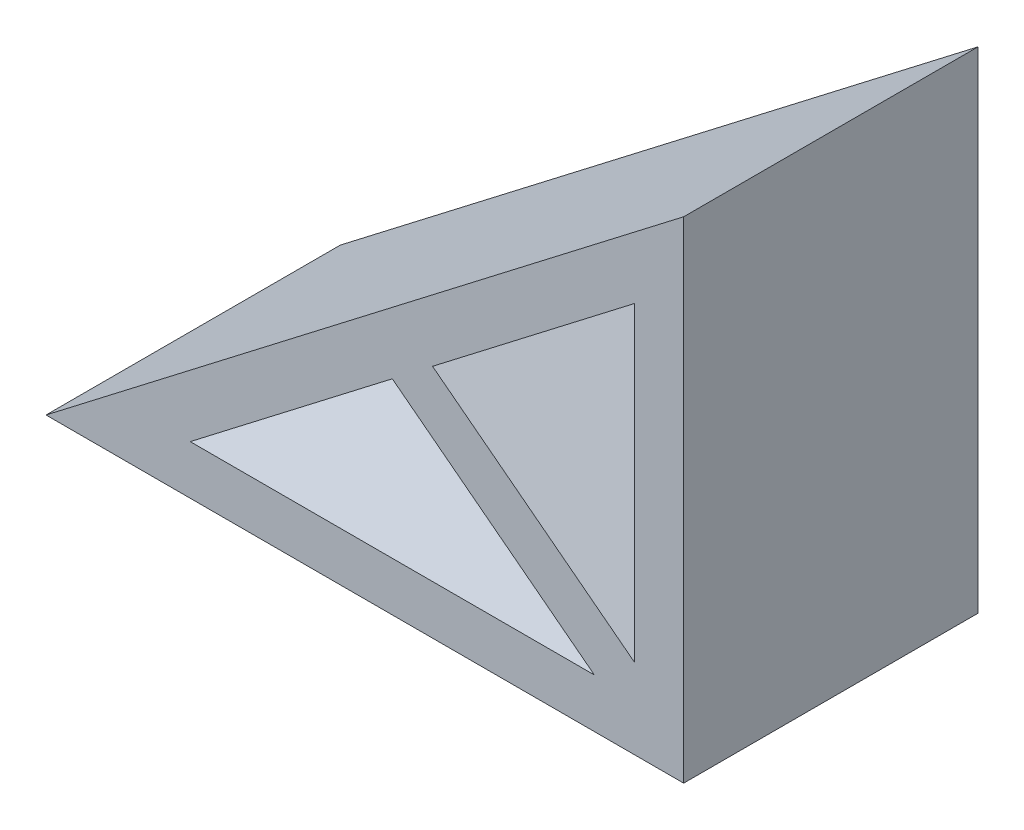
ISO-10303-21;
HEADER;
FILE_DESCRIPTION(('STEP AP214'),'2;1');
FILE_NAME('part.step','',(''),(''),'','','');
FILE_SCHEMA(('AUTOMOTIVE_DESIGN { 1 0 10303 214 1 1 1 1 }'));
ENDSEC;
DATA;
#1=APPLICATION_CONTEXT('core data for automotive mechanical design processes');
#2=APPLICATION_PROTOCOL_DEFINITION('international standard','automotive_design',2000,#1);
#3=PRODUCT_CONTEXT('',#1,'mechanical');
#4=PRODUCT('Part','Part','',(#3));
#5=PRODUCT_RELATED_PRODUCT_CATEGORY('part','',(#4));
#6=PRODUCT_DEFINITION_FORMATION('','',#4);
#7=PRODUCT_DEFINITION_CONTEXT('part definition',#1,'design');
#8=PRODUCT_DEFINITION('design','',#6,#7);
#9=PRODUCT_DEFINITION_SHAPE('','',#8);
#10=(LENGTH_UNIT() NAMED_UNIT(*) SI_UNIT(.MILLI.,.METRE.));
#11=(NAMED_UNIT(*) PLANE_ANGLE_UNIT() SI_UNIT($,.RADIAN.));
#12=(NAMED_UNIT(*) SI_UNIT($,.STERADIAN.) SOLID_ANGLE_UNIT());
#13=UNCERTAINTY_MEASURE_WITH_UNIT(LENGTH_MEASURE(1.E-05),#10,'distance_accuracy_value','');
#14=(GEOMETRIC_REPRESENTATION_CONTEXT(3) GLOBAL_UNCERTAINTY_ASSIGNED_CONTEXT((#13)) GLOBAL_UNIT_ASSIGNED_CONTEXT((#10,
#11,#12)) REPRESENTATION_CONTEXT('',''));
#15=CARTESIAN_POINT('',(0.,0.,0.));
#16=DIRECTION('',(0.,0.,1.));
#17=DIRECTION('',(1.,0.,0.));
#18=AXIS2_PLACEMENT_3D('',#15,#16,#17);
#19=CARTESIAN_POINT('',(0.,31.75,9.525));
#20=DIRECTION('',(-1.,0.,0.));
#21=DIRECTION('',(0.,0.,1.));
#22=AXIS2_PLACEMENT_3D('',#19,#20,#21);
#23=PLANE('',#22);
#24=DIRECTION('',(0.,1.,0.));
#25=VECTOR('',#24,1.);
#26=CARTESIAN_POINT('',(0.,31.75,-9.525));
#27=LINE('',#26,#25);
#28=CARTESIAN_POINT('',(0.,0.,-9.525));
#29=VERTEX_POINT('',#28);
#30=CARTESIAN_POINT('',(0.,31.75,-9.525));
#31=VERTEX_POINT('',#30);
#32=EDGE_CURVE('E152',#29,#31,#27,.T.);
#33=ORIENTED_EDGE('',*,*,#32,.T.);
#34=DIRECTION('',(0.,0.,-1.));
#35=VECTOR('',#34,1.);
#36=CARTESIAN_POINT('',(0.,31.75,9.525));
#37=LINE('',#36,#35);
#38=CARTESIAN_POINT('',(0.,31.75,9.525));
#39=VERTEX_POINT('',#38);
#40=EDGE_CURVE('E11',#39,#31,#37,.T.);
#41=ORIENTED_EDGE('',*,*,#40,.F.);
#42=DIRECTION('',(0.,1.,0.));
#43=VECTOR('',#42,1.);
#44=CARTESIAN_POINT('',(0.,31.75,9.525));
#45=LINE('',#44,#43);
#46=CARTESIAN_POINT('',(0.,0.,9.525));
#47=VERTEX_POINT('',#46);
#48=EDGE_CURVE('E156',#47,#39,#45,.T.);
#49=ORIENTED_EDGE('',*,*,#48,.F.);
#50=DIRECTION('',(0.,0.,-1.));
#51=VECTOR('',#50,1.);
#52=CARTESIAN_POINT('',(0.,0.,9.525));
#53=LINE('',#52,#51);
#54=EDGE_CURVE('E164',#47,#29,#53,.T.);
#55=ORIENTED_EDGE('',*,*,#54,.T.);
#56=EDGE_LOOP('',(#33,#41,#49,#55));
#57=FACE_BOUND('',#56,.T.);
#58=ADVANCED_FACE('F32',(#57),#23,.F.);
#59=CARTESIAN_POINT('',(-41.275,0.,9.525));
#60=DIRECTION('',(0.609710760849693,-0.7926239891046,0.));
#61=DIRECTION('',(0.7926239891046,0.609710760849693,0.));
#62=AXIS2_PLACEMENT_3D('',#59,#60,#61);
#63=PLANE('',#62);
#64=DIRECTION('',(-0.7926239891046,-0.609710760849693,0.));
#65=VECTOR('',#64,1.);
#66=CARTESIAN_POINT('',(-41.275,0.,-9.525));
#67=LINE('',#66,#65);
#68=CARTESIAN_POINT('',(-41.275,0.,-9.525));
#69=VERTEX_POINT('',#68);
#70=EDGE_CURVE('E167',#31,#69,#67,.T.);
#71=ORIENTED_EDGE('',*,*,#70,.T.);
#72=DIRECTION('',(0.,0.,-1.));
#73=VECTOR('',#72,1.);
#74=CARTESIAN_POINT('',(-41.275,0.,9.525));
#75=LINE('',#74,#73);
#76=CARTESIAN_POINT('',(-41.275,0.,9.525));
#77=VERTEX_POINT('',#76);
#78=EDGE_CURVE('E39',#77,#69,#75,.T.);
#79=ORIENTED_EDGE('',*,*,#78,.F.);
#80=DIRECTION('',(-0.7926239891046,-0.609710760849693,0.));
#81=VECTOR('',#80,1.);
#82=CARTESIAN_POINT('',(-41.275,0.,9.525));
#83=LINE('',#82,#81);
#84=EDGE_CURVE('E159',#39,#77,#83,.T.);
#85=ORIENTED_EDGE('',*,*,#84,.F.);
#86=ORIENTED_EDGE('',*,*,#40,.T.);
#87=EDGE_LOOP('',(#71,#79,#85,#86));
#88=FACE_BOUND('',#87,.T.);
#89=ADVANCED_FACE('F186',(#88),#63,.F.);
#90=CARTESIAN_POINT('',(0.,0.,9.525));
#91=DIRECTION('',(0.,1.,0.));
#92=DIRECTION('',(-1.,0.,0.));
#93=AXIS2_PLACEMENT_3D('',#90,#91,#92);
#94=PLANE('',#93);
#95=DIRECTION('',(1.,0.,0.));
#96=VECTOR('',#95,1.);
#97=CARTESIAN_POINT('',(0.,0.,-9.525));
#98=LINE('',#97,#96);
#99=EDGE_CURVE('E160',#69,#29,#98,.T.);
#100=ORIENTED_EDGE('',*,*,#99,.T.);
#101=ORIENTED_EDGE('',*,*,#54,.F.);
#102=DIRECTION('',(1.,0.,0.));
#103=VECTOR('',#102,1.);
#104=CARTESIAN_POINT('',(0.,0.,9.525));
#105=LINE('',#104,#103);
#106=EDGE_CURVE('E162',#77,#47,#105,.T.);
#107=ORIENTED_EDGE('',*,*,#106,.F.);
#108=ORIENTED_EDGE('',*,*,#78,.T.);
#109=EDGE_LOOP('',(#100,#101,#107,#108));
#110=FACE_BOUND('',#109,.T.);
#111=ADVANCED_FACE('F176',(#110),#94,.F.);
#112=CARTESIAN_POINT('',(0.,0.,9.525));
#113=DIRECTION('',(0.,0.,-1.));
#114=DIRECTION('',(-1.,0.,0.));
#115=AXIS2_PLACEMENT_3D('',#112,#113,#114);
#116=PLANE('',#115);
#117=DIRECTION('',(-0.7926239891046,0.609710760849693,0.));
#118=VECTOR('',#117,1.);
#119=CARTESIAN_POINT('',(-5.7786935903635,3.175,9.525));
#120=LINE('',#119,#118);
#121=CARTESIAN_POINT('',(-5.7786935903635,3.175,9.525));
#122=VERTEX_POINT('',#121);
#123=CARTESIAN_POINT('',(-18.8594032048182,13.2370843188113,9.525));
#124=VERTEX_POINT('',#123);
#125=EDGE_CURVE('E116',#122,#124,#120,.T.);
#126=ORIENTED_EDGE('',*,*,#125,.F.);
#127=DIRECTION('',(1.,0.,0.));
#128=VECTOR('',#127,1.);
#129=CARTESIAN_POINT('',(-31.940112819273,3.175,9.525));
#130=LINE('',#129,#128);
#131=CARTESIAN_POINT('',(-31.940112819273,3.175,9.525));
#132=VERTEX_POINT('',#131);
#133=EDGE_CURVE('E46',#132,#122,#130,.T.);
#134=ORIENTED_EDGE('',*,*,#133,.F.);
#135=DIRECTION('',(-0.7926239891046,-0.609710760849693,0.));
#136=VECTOR('',#135,1.);
#137=CARTESIAN_POINT('',(-18.8594032048182,13.2370843188113,9.525));
#138=LINE('',#137,#136);
#139=EDGE_CURVE('E106',#124,#132,#138,.T.);
#140=ORIENTED_EDGE('',*,*,#139,.F.);
#141=EDGE_LOOP('',(#126,#134,#140));
#142=FACE_BOUND('',#141,.T.);
#143=DIRECTION('',(-0.7926239891046,-0.609710760849693,0.));
#144=VECTOR('',#143,1.);
#145=CARTESIAN_POINT('',(-3.175,25.3020098609792,9.525));
#146=LINE('',#145,#144);
#147=CARTESIAN_POINT('',(-3.175,25.3020098609792,9.525));
#148=VERTEX_POINT('',#147);
#149=CARTESIAN_POINT('',(-16.2557096144547,15.2399255421679,9.525));
#150=VERTEX_POINT('',#149);
#151=EDGE_CURVE('E134',#148,#150,#146,.T.);
#152=ORIENTED_EDGE('',*,*,#151,.F.);
#153=DIRECTION('',(0.,1.,0.));
#154=VECTOR('',#153,1.);
#155=CARTESIAN_POINT('',(-3.175,5.17784122335654,9.525));
#156=LINE('',#155,#154);
#157=CARTESIAN_POINT('',(-3.175,5.17784122335654,9.525));
#158=VERTEX_POINT('',#157);
#159=EDGE_CURVE('E54',#158,#148,#156,.T.);
#160=ORIENTED_EDGE('',*,*,#159,.F.);
#161=DIRECTION('',(0.7926239891046,-0.609710760849693,0.));
#162=VECTOR('',#161,1.);
#163=CARTESIAN_POINT('',(-3.175,5.17784122335654,9.525));
#164=LINE('',#163,#162);
#165=EDGE_CURVE('E137',#150,#158,#164,.T.);
#166=ORIENTED_EDGE('',*,*,#165,.F.);
#167=EDGE_LOOP('',(#152,#160,#166));
#168=FACE_BOUND('',#167,.T.);
#169=ORIENTED_EDGE('',*,*,#48,.T.);
#170=ORIENTED_EDGE('',*,*,#84,.T.);
#171=ORIENTED_EDGE('',*,*,#106,.T.);
#172=EDGE_LOOP('',(#169,#170,#171));
#173=FACE_BOUND('',#172,.T.);
#174=ADVANCED_FACE('F120',(#142,#168,#173),#116,.F.);
#175=CARTESIAN_POINT('',(0.,0.,-9.525));
#176=DIRECTION('',(0.,0.,-1.));
#177=DIRECTION('',(-1.,0.,0.));
#178=AXIS2_PLACEMENT_3D('',#175,#176,#177);
#179=PLANE('',#178);
#180=DIRECTION('',(1.,0.,0.));
#181=VECTOR('',#180,1.);
#182=CARTESIAN_POINT('',(-31.940112819273,3.175,-9.525));
#183=LINE('',#182,#181);
#184=CARTESIAN_POINT('',(-31.940112819273,3.175,-9.525));
#185=VERTEX_POINT('',#184);
#186=CARTESIAN_POINT('',(-5.7786935903635,3.175,-9.525));
#187=VERTEX_POINT('',#186);
#188=EDGE_CURVE('E122',#185,#187,#183,.T.);
#189=ORIENTED_EDGE('',*,*,#188,.T.);
#190=DIRECTION('',(-0.7926239891046,0.609710760849693,0.));
#191=VECTOR('',#190,1.);
#192=CARTESIAN_POINT('',(-5.7786935903635,3.175,-9.525));
#193=LINE('',#192,#191);
#194=CARTESIAN_POINT('',(-18.8594032048182,13.2370843188113,-9.525));
#195=VERTEX_POINT('',#194);
#196=EDGE_CURVE('E125',#187,#195,#193,.T.);
#197=ORIENTED_EDGE('',*,*,#196,.T.);
#198=DIRECTION('',(-0.7926239891046,-0.609710760849693,0.));
#199=VECTOR('',#198,1.);
#200=CARTESIAN_POINT('',(-18.8594032048182,13.2370843188113,-9.525));
#201=LINE('',#200,#199);
#202=EDGE_CURVE('E108',#195,#185,#201,.T.);
#203=ORIENTED_EDGE('',*,*,#202,.T.);
#204=EDGE_LOOP('',(#189,#197,#203));
#205=FACE_BOUND('',#204,.T.);
#206=DIRECTION('',(0.,1.,0.));
#207=VECTOR('',#206,1.);
#208=CARTESIAN_POINT('',(-3.175,5.17784122335654,-9.525));
#209=LINE('',#208,#207);
#210=CARTESIAN_POINT('',(-3.175,5.17784122335654,-9.525));
#211=VERTEX_POINT('',#210);
#212=CARTESIAN_POINT('',(-3.175,25.3020098609792,-9.525));
#213=VERTEX_POINT('',#212);
#214=EDGE_CURVE('E140',#211,#213,#209,.T.);
#215=ORIENTED_EDGE('',*,*,#214,.T.);
#216=DIRECTION('',(-0.7926239891046,-0.609710760849693,0.));
#217=VECTOR('',#216,1.);
#218=CARTESIAN_POINT('',(-3.175,25.3020098609792,-9.525));
#219=LINE('',#218,#217);
#220=CARTESIAN_POINT('',(-16.2557096144547,15.2399255421679,-9.525));
#221=VERTEX_POINT('',#220);
#222=EDGE_CURVE('E143',#213,#221,#219,.T.);
#223=ORIENTED_EDGE('',*,*,#222,.T.);
#224=DIRECTION('',(0.7926239891046,-0.609710760849693,0.));
#225=VECTOR('',#224,1.);
#226=CARTESIAN_POINT('',(-3.175,5.17784122335654,-9.525));
#227=LINE('',#226,#225);
#228=EDGE_CURVE('E146',#221,#211,#227,.T.);
#229=ORIENTED_EDGE('',*,*,#228,.T.);
#230=EDGE_LOOP('',(#215,#223,#229));
#231=FACE_BOUND('',#230,.T.);
#232=ORIENTED_EDGE('',*,*,#32,.F.);
#233=ORIENTED_EDGE('',*,*,#99,.F.);
#234=ORIENTED_EDGE('',*,*,#70,.F.);
#235=EDGE_LOOP('',(#232,#233,#234));
#236=FACE_BOUND('',#235,.T.);
#237=ADVANCED_FACE('F181',(#205,#231,#236),#179,.T.);
#238=CARTESIAN_POINT('',(-3.175,5.17784122335654,-9.525));
#239=DIRECTION('',(1.,0.,0.));
#240=DIRECTION('',(0.,0.,-1.));
#241=AXIS2_PLACEMENT_3D('',#238,#239,#240);
#242=PLANE('',#241);
#243=DIRECTION('',(0.,0.,1.));
#244=VECTOR('',#243,1.);
#245=CARTESIAN_POINT('',(-3.175,25.3020098609792,-9.525));
#246=LINE('',#245,#244);
#247=EDGE_CURVE('E149',#213,#148,#246,.T.);
#248=ORIENTED_EDGE('',*,*,#247,.F.);
#249=ORIENTED_EDGE('',*,*,#214,.F.);
#250=DIRECTION('',(0.,0.,1.));
#251=VECTOR('',#250,1.);
#252=CARTESIAN_POINT('',(-3.175,5.17784122335654,-9.525));
#253=LINE('',#252,#251);
#254=EDGE_CURVE('E150',#211,#158,#253,.T.);
#255=ORIENTED_EDGE('',*,*,#254,.T.);
#256=ORIENTED_EDGE('',*,*,#159,.T.);
#257=EDGE_LOOP('',(#248,#249,#255,#256));
#258=FACE_BOUND('',#257,.T.);
#259=ADVANCED_FACE('F196',(#258),#242,.F.);
#260=CARTESIAN_POINT('',(-3.175,5.17784122335654,-9.525));
#261=DIRECTION('',(-0.609710760849693,-0.7926239891046,0.));
#262=DIRECTION('',(0.7926239891046,-0.609710760849693,0.));
#263=AXIS2_PLACEMENT_3D('',#260,#261,#262);
#264=PLANE('',#263);
#265=ORIENTED_EDGE('',*,*,#254,.F.);
#266=ORIENTED_EDGE('',*,*,#228,.F.);
#267=DIRECTION('',(0.,0.,1.));
#268=VECTOR('',#267,1.);
#269=CARTESIAN_POINT('',(-16.2557096144547,15.2399255421679,-9.525));
#270=LINE('',#269,#268);
#271=EDGE_CURVE('E153',#221,#150,#270,.T.);
#272=ORIENTED_EDGE('',*,*,#271,.T.);
#273=ORIENTED_EDGE('',*,*,#165,.T.);
#274=EDGE_LOOP('',(#265,#266,#272,#273));
#275=FACE_BOUND('',#274,.T.);
#276=ADVANCED_FACE('F202',(#275),#264,.F.);
#277=CARTESIAN_POINT('',(-3.175,25.3020098609792,-9.525));
#278=DIRECTION('',(-0.609710760849693,0.7926239891046,0.));
#279=DIRECTION('',(-0.7926239891046,-0.609710760849693,0.));
#280=AXIS2_PLACEMENT_3D('',#277,#278,#279);
#281=PLANE('',#280);
#282=ORIENTED_EDGE('',*,*,#271,.F.);
#283=ORIENTED_EDGE('',*,*,#222,.F.);
#284=ORIENTED_EDGE('',*,*,#247,.T.);
#285=ORIENTED_EDGE('',*,*,#151,.T.);
#286=EDGE_LOOP('',(#282,#283,#284,#285));
#287=FACE_BOUND('',#286,.T.);
#288=ADVANCED_FACE('F203',(#287),#281,.F.);
#289=CARTESIAN_POINT('',(-31.940112819273,3.175,-9.525));
#290=DIRECTION('',(0.,-1.,0.));
#291=DIRECTION('',(1.,0.,0.));
#292=AXIS2_PLACEMENT_3D('',#289,#290,#291);
#293=PLANE('',#292);
#294=DIRECTION('',(0.,0.,1.));
#295=VECTOR('',#294,1.);
#296=CARTESIAN_POINT('',(-5.7786935903635,3.175,-9.525));
#297=LINE('',#296,#295);
#298=EDGE_CURVE('E113',#187,#122,#297,.T.);
#299=ORIENTED_EDGE('',*,*,#298,.F.);
#300=ORIENTED_EDGE('',*,*,#188,.F.);
#301=DIRECTION('',(0.,0.,1.));
#302=VECTOR('',#301,1.);
#303=CARTESIAN_POINT('',(-31.940112819273,3.175,-9.525));
#304=LINE('',#303,#302);
#305=EDGE_CURVE('E112',#185,#132,#304,.T.);
#306=ORIENTED_EDGE('',*,*,#305,.T.);
#307=ORIENTED_EDGE('',*,*,#133,.T.);
#308=EDGE_LOOP('',(#299,#300,#306,#307));
#309=FACE_BOUND('',#308,.T.);
#310=ADVANCED_FACE('F206',(#309),#293,.F.);
#311=CARTESIAN_POINT('',(-18.8594032048182,13.2370843188113,-9.525));
#312=DIRECTION('',(-0.609710760849693,0.7926239891046,0.));
#313=DIRECTION('',(-0.7926239891046,-0.609710760849693,0.));
#314=AXIS2_PLACEMENT_3D('',#311,#312,#313);
#315=PLANE('',#314);
#316=ORIENTED_EDGE('',*,*,#305,.F.);
#317=ORIENTED_EDGE('',*,*,#202,.F.);
#318=DIRECTION('',(0.,0.,1.));
#319=VECTOR('',#318,1.);
#320=CARTESIAN_POINT('',(-18.8594032048182,13.2370843188113,-9.525));
#321=LINE('',#320,#319);
#322=EDGE_CURVE('E102',#195,#124,#321,.T.);
#323=ORIENTED_EDGE('',*,*,#322,.T.);
#324=ORIENTED_EDGE('',*,*,#139,.T.);
#325=EDGE_LOOP('',(#316,#317,#323,#324));
#326=FACE_BOUND('',#325,.T.);
#327=ADVANCED_FACE('F104',(#326),#315,.F.);
#328=CARTESIAN_POINT('',(-5.7786935903635,3.175,-9.525));
#329=DIRECTION('',(0.609710760849693,0.7926239891046,0.));
#330=DIRECTION('',(-0.7926239891046,0.609710760849693,0.));
#331=AXIS2_PLACEMENT_3D('',#328,#329,#330);
#332=PLANE('',#331);
#333=ORIENTED_EDGE('',*,*,#322,.F.);
#334=ORIENTED_EDGE('',*,*,#196,.F.);
#335=ORIENTED_EDGE('',*,*,#298,.T.);
#336=ORIENTED_EDGE('',*,*,#125,.T.);
#337=EDGE_LOOP('',(#333,#334,#335,#336));
#338=FACE_BOUND('',#337,.T.);
#339=ADVANCED_FACE('F117',(#338),#332,.F.);
#340=CLOSED_SHELL('',(#58,#89,#111,#174,#237,#259,#276,#288,#310,#327,#339));
#341=MANIFOLD_SOLID_BREP('B2',#340);
#342=ADVANCED_BREP_SHAPE_REPRESENTATION('',(#18,#341),#14);
#343=SHAPE_DEFINITION_REPRESENTATION(#9,#342);
ENDSEC;
END-ISO-10303-21;
